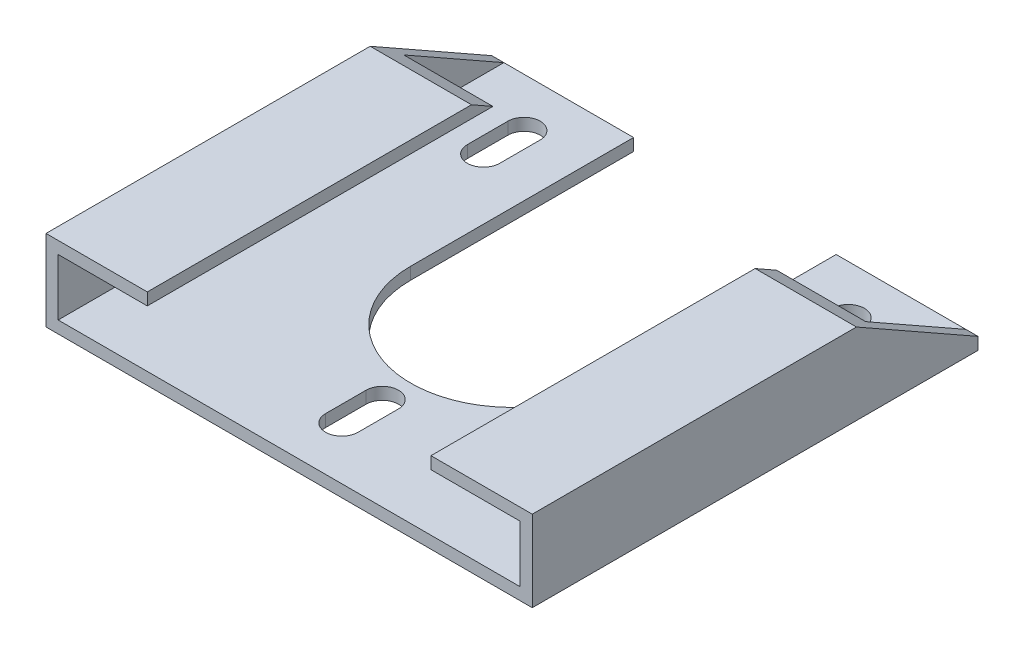
ISO-10303-21;
HEADER;
FILE_DESCRIPTION(('STEP AP214'),'2;1');
FILE_NAME('part.step','',(''),(''),'','','');
FILE_SCHEMA(('AUTOMOTIVE_DESIGN { 1 0 10303 214 1 1 1 1 }'));
ENDSEC;
DATA;
#1=APPLICATION_CONTEXT('core data for automotive mechanical design processes');
#2=APPLICATION_PROTOCOL_DEFINITION('international standard','automotive_design',2000,#1);
#3=PRODUCT_CONTEXT('',#1,'mechanical');
#4=PRODUCT('Part','Part','',(#3));
#5=PRODUCT_RELATED_PRODUCT_CATEGORY('part','',(#4));
#6=PRODUCT_DEFINITION_FORMATION('','',#4);
#7=PRODUCT_DEFINITION_CONTEXT('part definition',#1,'design');
#8=PRODUCT_DEFINITION('design','',#6,#7);
#9=PRODUCT_DEFINITION_SHAPE('','',#8);
#10=(LENGTH_UNIT() NAMED_UNIT(*) SI_UNIT(.MILLI.,.METRE.));
#11=(NAMED_UNIT(*) PLANE_ANGLE_UNIT() SI_UNIT($,.RADIAN.));
#12=(NAMED_UNIT(*) SI_UNIT($,.STERADIAN.) SOLID_ANGLE_UNIT());
#13=UNCERTAINTY_MEASURE_WITH_UNIT(LENGTH_MEASURE(1.E-05),#10,'distance_accuracy_value','');
#14=(GEOMETRIC_REPRESENTATION_CONTEXT(3) GLOBAL_UNCERTAINTY_ASSIGNED_CONTEXT((#13)) GLOBAL_UNIT_ASSIGNED_CONTEXT((#10,
#11,#12)) REPRESENTATION_CONTEXT('',''));
#15=CARTESIAN_POINT('',(0.,0.,0.));
#16=DIRECTION('',(0.,0.,1.));
#17=DIRECTION('',(1.,0.,0.));
#18=AXIS2_PLACEMENT_3D('',#15,#16,#17);
#19=CARTESIAN_POINT('',(0.,3.,0.));
#20=DIRECTION('',(0.,1.,0.));
#21=DIRECTION('',(0.,0.,1.));
#22=AXIS2_PLACEMENT_3D('',#19,#20,#21);
#23=PLANE('',#22);
#24=CARTESIAN_POINT('',(0.,3.,32.));
#25=DIRECTION('',(0.,1.,0.));
#26=DIRECTION('',(0.,0.,1.));
#27=AXIS2_PLACEMENT_3D('',#24,#25,#26);
#28=CIRCLE('',#27,4.);
#29=CARTESIAN_POINT('',(4.,3.,32.));
#30=VERTEX_POINT('',#29);
#31=CARTESIAN_POINT('',(-4.,3.,32.));
#32=VERTEX_POINT('',#31);
#33=EDGE_CURVE('E49',#30,#32,#28,.T.);
#34=ORIENTED_EDGE('',*,*,#33,.F.);
#35=DIRECTION('',(0.,0.,-1.));
#36=VECTOR('',#35,1.);
#37=CARTESIAN_POINT('',(4.,3.,32.));
#38=LINE('',#37,#36);
#39=CARTESIAN_POINT('',(4.,3.,42.));
#40=VERTEX_POINT('',#39);
#41=EDGE_CURVE('E243',#40,#30,#38,.T.);
#42=ORIENTED_EDGE('',*,*,#41,.F.);
#43=CARTESIAN_POINT('',(0.,3.,42.));
#44=DIRECTION('',(0.,1.,0.));
#45=DIRECTION('',(0.,0.,1.));
#46=AXIS2_PLACEMENT_3D('',#43,#44,#45);
#47=CIRCLE('',#46,4.);
#48=CARTESIAN_POINT('',(-4.,3.,42.));
#49=VERTEX_POINT('',#48);
#50=EDGE_CURVE('E228',#49,#40,#47,.T.);
#51=ORIENTED_EDGE('',*,*,#50,.F.);
#52=DIRECTION('',(0.,0.,1.));
#53=VECTOR('',#52,1.);
#54=CARTESIAN_POINT('',(-4.,3.,32.));
#55=LINE('',#54,#53);
#56=EDGE_CURVE('E237',#32,#49,#55,.T.);
#57=ORIENTED_EDGE('',*,*,#56,.F.);
#58=EDGE_LOOP('',(#34,#42,#51,#57));
#59=FACE_BOUND('',#58,.T.);
#60=CARTESIAN_POINT('',(0.,3.,0.));
#61=DIRECTION('',(0.,1.,0.));
#62=DIRECTION('',(0.,0.,1.));
#63=AXIS2_PLACEMENT_3D('',#60,#61,#62);
#64=CIRCLE('',#63,25.);
#65=CARTESIAN_POINT('',(-25.,3.,0.));
#66=VERTEX_POINT('',#65);
#67=CARTESIAN_POINT('',(25.,3.,0.));
#68=VERTEX_POINT('',#67);
#69=EDGE_CURVE('E492',#66,#68,#64,.T.);
#70=ORIENTED_EDGE('',*,*,#69,.F.);
#71=DIRECTION('',(0.,0.,-1.));
#72=VECTOR('',#71,1.);
#73=CARTESIAN_POINT('',(-25.,3.,0.));
#74=LINE('',#73,#72);
#75=CARTESIAN_POINT('',(-25.,3.,-55.));
#76=VERTEX_POINT('',#75);
#77=EDGE_CURVE('E510',#66,#76,#74,.T.);
#78=ORIENTED_EDGE('',*,*,#77,.T.);
#79=DIRECTION('',(1.,0.,0.));
#80=VECTOR('',#79,1.);
#81=CARTESIAN_POINT('',(0.,3.,-55.));
#82=LINE('',#81,#80);
#83=CARTESIAN_POINT('',(-57.,3.00000000000002,-55.));
#84=VERTEX_POINT('',#83);
#85=EDGE_CURVE('E505',#84,#76,#82,.T.);
#86=ORIENTED_EDGE('',*,*,#85,.F.);
#87=DIRECTION('',(0.,0.,1.));
#88=VECTOR('',#87,1.);
#89=CARTESIAN_POINT('',(-57.,3.,0.));
#90=LINE('',#89,#88);
#91=CARTESIAN_POINT('',(-57.,3.,55.));
#92=VERTEX_POINT('',#91);
#93=EDGE_CURVE('E500',#84,#92,#90,.T.);
#94=ORIENTED_EDGE('',*,*,#93,.T.);
#95=DIRECTION('',(1.,0.,0.));
#96=VECTOR('',#95,1.);
#97=CARTESIAN_POINT('',(0.,3.,55.));
#98=LINE('',#97,#96);
#99=CARTESIAN_POINT('',(57.,3.,55.));
#100=VERTEX_POINT('',#99);
#101=EDGE_CURVE('E504',#92,#100,#98,.T.);
#102=ORIENTED_EDGE('',*,*,#101,.T.);
#103=DIRECTION('',(0.,0.,1.));
#104=VECTOR('',#103,1.);
#105=CARTESIAN_POINT('',(57.,3.,0.));
#106=LINE('',#105,#104);
#107=CARTESIAN_POINT('',(57.,3.,-55.));
#108=VERTEX_POINT('',#107);
#109=EDGE_CURVE('E515',#108,#100,#106,.T.);
#110=ORIENTED_EDGE('',*,*,#109,.F.);
#111=DIRECTION('',(1.,0.,0.));
#112=VECTOR('',#111,1.);
#113=CARTESIAN_POINT('',(0.,3.,-55.));
#114=LINE('',#113,#112);
#115=CARTESIAN_POINT('',(25.,3.,-55.));
#116=VERTEX_POINT('',#115);
#117=EDGE_CURVE('E519',#116,#108,#114,.T.);
#118=ORIENTED_EDGE('',*,*,#117,.F.);
#119=DIRECTION('',(0.,0.,-1.));
#120=VECTOR('',#119,1.);
#121=CARTESIAN_POINT('',(25.,3.,0.));
#122=LINE('',#121,#120);
#123=EDGE_CURVE('E496',#68,#116,#122,.T.);
#124=ORIENTED_EDGE('',*,*,#123,.F.);
#125=EDGE_LOOP('',(#70,#78,#86,#94,#102,#110,#118,#124));
#126=FACE_BOUND('',#125,.T.);
#127=CARTESIAN_POINT('',(-40.,3.,-42.9741891997697));
#128=DIRECTION('',(0.,1.,0.));
#129=DIRECTION('',(0.,0.,1.));
#130=AXIS2_PLACEMENT_3D('',#127,#128,#129);
#131=CIRCLE('',#130,4.);
#132=CARTESIAN_POINT('',(-36.,3.,-42.9741891997697));
#133=VERTEX_POINT('',#132);
#134=CARTESIAN_POINT('',(-44.,3.,-42.9741891997697));
#135=VERTEX_POINT('',#134);
#136=EDGE_CURVE('E267',#133,#135,#131,.T.);
#137=ORIENTED_EDGE('',*,*,#136,.F.);
#138=DIRECTION('',(0.,0.,-1.));
#139=VECTOR('',#138,1.);
#140=CARTESIAN_POINT('',(-36.,3.,-42.9741891997697));
#141=LINE('',#140,#139);
#142=CARTESIAN_POINT('',(-36.,3.,-32.9741891997697));
#143=VERTEX_POINT('',#142);
#144=EDGE_CURVE('E281',#143,#133,#141,.T.);
#145=ORIENTED_EDGE('',*,*,#144,.F.);
#146=CARTESIAN_POINT('',(-40.,3.,-32.9741891997697));
#147=DIRECTION('',(0.,1.,0.));
#148=DIRECTION('',(0.,0.,1.));
#149=AXIS2_PLACEMENT_3D('',#146,#147,#148);
#150=CIRCLE('',#149,4.);
#151=CARTESIAN_POINT('',(-44.,3.,-32.9741891997697));
#152=VERTEX_POINT('',#151);
#153=EDGE_CURVE('E278',#152,#143,#150,.T.);
#154=ORIENTED_EDGE('',*,*,#153,.F.);
#155=DIRECTION('',(0.,0.,1.));
#156=VECTOR('',#155,1.);
#157=CARTESIAN_POINT('',(-44.,3.,-42.9741891997697));
#158=LINE('',#157,#156);
#159=EDGE_CURVE('E275',#135,#152,#158,.T.);
#160=ORIENTED_EDGE('',*,*,#159,.F.);
#161=EDGE_LOOP('',(#137,#145,#154,#160));
#162=FACE_BOUND('',#161,.T.);
#163=DIRECTION('',(0.,0.,-1.));
#164=VECTOR('',#163,1.);
#165=CARTESIAN_POINT('',(36.,3.,-42.9741891997697));
#166=LINE('',#165,#164);
#167=CARTESIAN_POINT('',(36.,3.,-32.9741891997697));
#168=VERTEX_POINT('',#167);
#169=CARTESIAN_POINT('',(36.,3.,-42.9741891997697));
#170=VERTEX_POINT('',#169);
#171=EDGE_CURVE('E255',#168,#170,#166,.T.);
#172=ORIENTED_EDGE('',*,*,#171,.T.);
#173=CARTESIAN_POINT('',(40.,3.,-42.9741891997697));
#174=DIRECTION('',(0.,-1.,0.));
#175=DIRECTION('',(0.,0.,1.));
#176=AXIS2_PLACEMENT_3D('',#173,#174,#175);
#177=CIRCLE('',#176,4.);
#178=CARTESIAN_POINT('',(44.,3.,-42.9741891997697));
#179=VERTEX_POINT('',#178);
#180=EDGE_CURVE('E250',#170,#179,#177,.T.);
#181=ORIENTED_EDGE('',*,*,#180,.T.);
#182=DIRECTION('',(0.,0.,1.));
#183=VECTOR('',#182,1.);
#184=CARTESIAN_POINT('',(44.,3.,-42.9741891997697));
#185=LINE('',#184,#183);
#186=CARTESIAN_POINT('',(44.,3.,-32.9741891997697));
#187=VERTEX_POINT('',#186);
#188=EDGE_CURVE('E261',#179,#187,#185,.T.);
#189=ORIENTED_EDGE('',*,*,#188,.T.);
#190=CARTESIAN_POINT('',(40.,3.,-32.9741891997697));
#191=DIRECTION('',(0.,-1.,0.));
#192=DIRECTION('',(0.,0.,1.));
#193=AXIS2_PLACEMENT_3D('',#190,#191,#192);
#194=CIRCLE('',#193,4.);
#195=EDGE_CURVE('E258',#187,#168,#194,.T.);
#196=ORIENTED_EDGE('',*,*,#195,.T.);
#197=EDGE_LOOP('',(#172,#181,#189,#196));
#198=FACE_BOUND('',#197,.T.);
#199=ADVANCED_FACE('F34',(#59,#126,#162,#198),#23,.T.);
#200=CARTESIAN_POINT('',(0.,0.,0.));
#201=DIRECTION('',(0.,1.,0.));
#202=DIRECTION('',(0.,0.,1.));
#203=AXIS2_PLACEMENT_3D('',#200,#201,#202);
#204=PLANE('',#203);
#205=DIRECTION('',(0.,0.,-1.));
#206=VECTOR('',#205,1.);
#207=CARTESIAN_POINT('',(3.99999999999999,0.,0.));
#208=LINE('',#207,#206);
#209=CARTESIAN_POINT('',(4.,0.,42.));
#210=VERTEX_POINT('',#209);
#211=CARTESIAN_POINT('',(4.,0.,32.));
#212=VERTEX_POINT('',#211);
#213=EDGE_CURVE('E42',#210,#212,#208,.T.);
#214=ORIENTED_EDGE('',*,*,#213,.T.);
#215=CARTESIAN_POINT('',(0.,0.,32.));
#216=DIRECTION('',(0.,1.,0.));
#217=DIRECTION('',(0.,0.,1.));
#218=AXIS2_PLACEMENT_3D('',#215,#216,#217);
#219=CIRCLE('',#218,4.);
#220=CARTESIAN_POINT('',(-4.,0.,32.));
#221=VERTEX_POINT('',#220);
#222=EDGE_CURVE('E11',#212,#221,#219,.T.);
#223=ORIENTED_EDGE('',*,*,#222,.T.);
#224=DIRECTION('',(0.,0.,1.));
#225=VECTOR('',#224,1.);
#226=CARTESIAN_POINT('',(-4.,0.,0.));
#227=LINE('',#226,#225);
#228=CARTESIAN_POINT('',(-4.,0.,42.));
#229=VERTEX_POINT('',#228);
#230=EDGE_CURVE('E405',#221,#229,#227,.T.);
#231=ORIENTED_EDGE('',*,*,#230,.T.);
#232=CARTESIAN_POINT('',(0.,0.,42.));
#233=DIRECTION('',(0.,1.,0.));
#234=DIRECTION('',(0.,0.,1.));
#235=AXIS2_PLACEMENT_3D('',#232,#233,#234);
#236=CIRCLE('',#235,4.);
#237=EDGE_CURVE('E231',#229,#210,#236,.T.);
#238=ORIENTED_EDGE('',*,*,#237,.T.);
#239=EDGE_LOOP('',(#214,#223,#231,#238));
#240=FACE_BOUND('',#239,.T.);
#241=CARTESIAN_POINT('',(0.,0.,0.));
#242=DIRECTION('',(0.,1.,0.));
#243=DIRECTION('',(0.,0.,1.));
#244=AXIS2_PLACEMENT_3D('',#241,#242,#243);
#245=CIRCLE('',#244,25.);
#246=CARTESIAN_POINT('',(-25.,0.,0.));
#247=VERTEX_POINT('',#246);
#248=CARTESIAN_POINT('',(25.,0.,0.));
#249=VERTEX_POINT('',#248);
#250=EDGE_CURVE('E474',#247,#249,#245,.T.);
#251=ORIENTED_EDGE('',*,*,#250,.T.);
#252=DIRECTION('',(0.,0.,-1.));
#253=VECTOR('',#252,1.);
#254=CARTESIAN_POINT('',(25.,0.,0.));
#255=LINE('',#254,#253);
#256=CARTESIAN_POINT('',(25.,0.,-55.));
#257=VERTEX_POINT('',#256);
#258=EDGE_CURVE('E489',#249,#257,#255,.T.);
#259=ORIENTED_EDGE('',*,*,#258,.T.);
#260=DIRECTION('',(1.,0.,0.));
#261=VECTOR('',#260,1.);
#262=CARTESIAN_POINT('',(0.,0.,-55.));
#263=LINE('',#262,#261);
#264=CARTESIAN_POINT('',(60.,0.,-55.));
#265=VERTEX_POINT('',#264);
#266=EDGE_CURVE('E483',#257,#265,#263,.T.);
#267=ORIENTED_EDGE('',*,*,#266,.T.);
#268=DIRECTION('',(0.,0.,1.));
#269=VECTOR('',#268,1.);
#270=CARTESIAN_POINT('',(60.,0.,0.));
#271=LINE('',#270,#269);
#272=CARTESIAN_POINT('',(60.,0.,55.));
#273=VERTEX_POINT('',#272);
#274=EDGE_CURVE('E356',#265,#273,#271,.T.);
#275=ORIENTED_EDGE('',*,*,#274,.T.);
#276=DIRECTION('',(1.,0.,0.));
#277=VECTOR('',#276,1.);
#278=CARTESIAN_POINT('',(0.,0.,55.));
#279=LINE('',#278,#277);
#280=CARTESIAN_POINT('',(-60.,0.,55.));
#281=VERTEX_POINT('',#280);
#282=EDGE_CURVE('E481',#281,#273,#279,.T.);
#283=ORIENTED_EDGE('',*,*,#282,.F.);
#284=DIRECTION('',(0.,0.,1.));
#285=VECTOR('',#284,1.);
#286=CARTESIAN_POINT('',(-60.,0.,0.));
#287=LINE('',#286,#285);
#288=CARTESIAN_POINT('',(-60.,0.,-55.));
#289=VERTEX_POINT('',#288);
#290=EDGE_CURVE('E377',#289,#281,#287,.T.);
#291=ORIENTED_EDGE('',*,*,#290,.F.);
#292=DIRECTION('',(1.,0.,0.));
#293=VECTOR('',#292,1.);
#294=CARTESIAN_POINT('',(0.,0.,-55.));
#295=LINE('',#294,#293);
#296=CARTESIAN_POINT('',(-25.,0.,-55.));
#297=VERTEX_POINT('',#296);
#298=EDGE_CURVE('E473',#289,#297,#295,.T.);
#299=ORIENTED_EDGE('',*,*,#298,.T.);
#300=DIRECTION('',(0.,0.,-1.));
#301=VECTOR('',#300,1.);
#302=CARTESIAN_POINT('',(-25.,0.,0.));
#303=LINE('',#302,#301);
#304=EDGE_CURVE('E466',#247,#297,#303,.T.);
#305=ORIENTED_EDGE('',*,*,#304,.F.);
#306=EDGE_LOOP('',(#251,#259,#267,#275,#283,#291,#299,#305));
#307=FACE_BOUND('',#306,.T.);
#308=DIRECTION('',(0.,0.,-1.));
#309=VECTOR('',#308,1.);
#310=CARTESIAN_POINT('',(-36.,0.,0.));
#311=LINE('',#310,#309);
#312=CARTESIAN_POINT('',(-36.,0.,-32.9741891997697));
#313=VERTEX_POINT('',#312);
#314=CARTESIAN_POINT('',(-36.,0.,-42.9741891997697));
#315=VERTEX_POINT('',#314);
#316=EDGE_CURVE('E390',#313,#315,#311,.T.);
#317=ORIENTED_EDGE('',*,*,#316,.T.);
#318=CARTESIAN_POINT('',(-40.,0.,-42.9741891997697));
#319=DIRECTION('',(0.,1.,0.));
#320=DIRECTION('',(0.,0.,1.));
#321=AXIS2_PLACEMENT_3D('',#318,#319,#320);
#322=CIRCLE('',#321,4.);
#323=CARTESIAN_POINT('',(-44.,0.,-42.9741891997697));
#324=VERTEX_POINT('',#323);
#325=EDGE_CURVE('E393',#315,#324,#322,.T.);
#326=ORIENTED_EDGE('',*,*,#325,.T.);
#327=DIRECTION('',(0.,0.,1.));
#328=VECTOR('',#327,1.);
#329=CARTESIAN_POINT('',(-44.,0.,0.));
#330=LINE('',#329,#328);
#331=CARTESIAN_POINT('',(-44.,0.,-32.9741891997697));
#332=VERTEX_POINT('',#331);
#333=EDGE_CURVE('E383',#324,#332,#330,.T.);
#334=ORIENTED_EDGE('',*,*,#333,.T.);
#335=CARTESIAN_POINT('',(-40.,0.,-32.9741891997697));
#336=DIRECTION('',(0.,1.,0.));
#337=DIRECTION('',(0.,0.,1.));
#338=AXIS2_PLACEMENT_3D('',#335,#336,#337);
#339=CIRCLE('',#338,4.);
#340=EDGE_CURVE('E387',#332,#313,#339,.T.);
#341=ORIENTED_EDGE('',*,*,#340,.T.);
#342=EDGE_LOOP('',(#317,#326,#334,#341));
#343=FACE_BOUND('',#342,.T.);
#344=CARTESIAN_POINT('',(40.,0.,-42.9741891997697));
#345=DIRECTION('',(0.,1.,0.));
#346=DIRECTION('',(0.,0.,1.));
#347=AXIS2_PLACEMENT_3D('',#344,#345,#346);
#348=CIRCLE('',#347,4.);
#349=CARTESIAN_POINT('',(36.,0.,-42.9741891997697));
#350=VERTEX_POINT('',#349);
#351=CARTESIAN_POINT('',(44.,0.,-42.9741891997697));
#352=VERTEX_POINT('',#351);
#353=EDGE_CURVE('E403',#350,#352,#348,.F.);
#354=ORIENTED_EDGE('',*,*,#353,.F.);
#355=DIRECTION('',(0.,0.,-1.));
#356=VECTOR('',#355,1.);
#357=CARTESIAN_POINT('',(36.,0.,0.));
#358=LINE('',#357,#356);
#359=CARTESIAN_POINT('',(36.,0.,-32.9741891997697));
#360=VERTEX_POINT('',#359);
#361=EDGE_CURVE('E396',#360,#350,#358,.T.);
#362=ORIENTED_EDGE('',*,*,#361,.F.);
#363=CARTESIAN_POINT('',(40.,0.,-32.9741891997697));
#364=DIRECTION('',(0.,1.,0.));
#365=DIRECTION('',(0.,0.,1.));
#366=AXIS2_PLACEMENT_3D('',#363,#364,#365);
#367=CIRCLE('',#366,4.);
#368=CARTESIAN_POINT('',(44.,0.,-32.9741891997697));
#369=VERTEX_POINT('',#368);
#370=EDGE_CURVE('E398',#369,#360,#367,.F.);
#371=ORIENTED_EDGE('',*,*,#370,.F.);
#372=DIRECTION('',(0.,0.,1.));
#373=VECTOR('',#372,1.);
#374=CARTESIAN_POINT('',(44.,0.,0.));
#375=LINE('',#374,#373);
#376=EDGE_CURVE('E401',#352,#369,#375,.T.);
#377=ORIENTED_EDGE('',*,*,#376,.F.);
#378=EDGE_LOOP('',(#354,#362,#371,#377));
#379=FACE_BOUND('',#378,.T.);
#380=ADVANCED_FACE('F409',(#240,#307,#343,#379),#204,.F.);
#381=CARTESIAN_POINT('',(-57.,20.,0.));
#382=DIRECTION('',(1.,0.,0.));
#383=DIRECTION('',(0.,0.,-1.));
#384=AXIS2_PLACEMENT_3D('',#381,#382,#383);
#385=PLANE('',#384);
#386=ORIENTED_EDGE('',*,*,#93,.F.);
#387=DIRECTION('',(0.,0.49301257198088,0.870022185848612));
#388=VECTOR('',#387,1.);
#389=CARTESIAN_POINT('',(-57.,30.7232968881413,-6.07653490328007));
#390=LINE('',#389,#388);
#391=CARTESIAN_POINT('',(-57.,17.,-30.2941176470589));
#392=VERTEX_POINT('',#391);
#393=EDGE_CURVE('E323',#84,#392,#390,.T.);
#394=ORIENTED_EDGE('',*,*,#393,.T.);
#395=DIRECTION('',(0.,0.,-1.));
#396=VECTOR('',#395,1.);
#397=CARTESIAN_POINT('',(-57.,17.,-55.));
#398=LINE('',#397,#396);
#399=CARTESIAN_POINT('',(-57.,17.,55.));
#400=VERTEX_POINT('',#399);
#401=EDGE_CURVE('E343',#400,#392,#398,.T.);
#402=ORIENTED_EDGE('',*,*,#401,.F.);
#403=DIRECTION('',(0.,-1.,0.));
#404=VECTOR('',#403,1.);
#405=CARTESIAN_POINT('',(-57.,20.,55.));
#406=LINE('',#405,#404);
#407=EDGE_CURVE('E378',#400,#92,#406,.T.);
#408=ORIENTED_EDGE('',*,*,#407,.T.);
#409=EDGE_LOOP('',(#386,#394,#402,#408));
#410=FACE_BOUND('',#409,.T.);
#411=ADVANCED_FACE('F433',(#410),#385,.T.);
#412=CARTESIAN_POINT('',(0.,3.,-55.));
#413=DIRECTION('',(0.,0.,-1.));
#414=DIRECTION('',(-1.,0.,0.));
#415=AXIS2_PLACEMENT_3D('',#412,#413,#414);
#416=PLANE('',#415);
#417=DIRECTION('',(0.,-1.,0.));
#418=VECTOR('',#417,1.);
#419=CARTESIAN_POINT('',(-60.,20.,-55.));
#420=LINE('',#419,#418);
#421=CARTESIAN_POINT('',(-60.,3.00000000000002,-55.));
#422=VERTEX_POINT('',#421);
#423=EDGE_CURVE('E562',#422,#289,#420,.T.);
#424=ORIENTED_EDGE('',*,*,#423,.F.);
#425=DIRECTION('',(1.,0.,0.));
#426=VECTOR('',#425,1.);
#427=CARTESIAN_POINT('',(0.,3.00000000000002,-55.));
#428=LINE('',#427,#426);
#429=EDGE_CURVE('E320',#422,#84,#428,.T.);
#430=ORIENTED_EDGE('',*,*,#429,.T.);
#431=ORIENTED_EDGE('',*,*,#85,.T.);
#432=DIRECTION('',(0.,-1.,0.));
#433=VECTOR('',#432,1.);
#434=CARTESIAN_POINT('',(-25.,3.,-55.));
#435=LINE('',#434,#433);
#436=EDGE_CURVE('E469',#76,#297,#435,.T.);
#437=ORIENTED_EDGE('',*,*,#436,.T.);
#438=ORIENTED_EDGE('',*,*,#298,.F.);
#439=EDGE_LOOP('',(#424,#430,#431,#437,#438));
#440=FACE_BOUND('',#439,.T.);
#441=ADVANCED_FACE('F448',(#440),#416,.T.);
#442=CARTESIAN_POINT('',(0.,3.,-55.));
#443=DIRECTION('',(0.,0.,-1.));
#444=DIRECTION('',(-1.,0.,0.));
#445=AXIS2_PLACEMENT_3D('',#442,#443,#444);
#446=PLANE('',#445);
#447=ORIENTED_EDGE('',*,*,#117,.T.);
#448=DIRECTION('',(1.,0.,0.));
#449=VECTOR('',#448,1.);
#450=CARTESIAN_POINT('',(0.,3.00000000000002,-55.));
#451=LINE('',#450,#449);
#452=CARTESIAN_POINT('',(60.,3.00000000000002,-55.));
#453=VERTEX_POINT('',#452);
#454=EDGE_CURVE('E304',#108,#453,#451,.T.);
#455=ORIENTED_EDGE('',*,*,#454,.T.);
#456=DIRECTION('',(0.,-1.,0.));
#457=VECTOR('',#456,1.);
#458=CARTESIAN_POINT('',(60.,20.,-55.));
#459=LINE('',#458,#457);
#460=EDGE_CURVE('E362',#453,#265,#459,.T.);
#461=ORIENTED_EDGE('',*,*,#460,.T.);
#462=ORIENTED_EDGE('',*,*,#266,.F.);
#463=DIRECTION('',(0.,-1.,0.));
#464=VECTOR('',#463,1.);
#465=CARTESIAN_POINT('',(25.,3.,-55.));
#466=LINE('',#465,#464);
#467=EDGE_CURVE('E495',#116,#257,#466,.T.);
#468=ORIENTED_EDGE('',*,*,#467,.F.);
#469=EDGE_LOOP('',(#447,#455,#461,#462,#468));
#470=FACE_BOUND('',#469,.T.);
#471=ADVANCED_FACE('F445',(#470),#446,.T.);
#472=CARTESIAN_POINT('',(-60.,20.,0.));
#473=DIRECTION('',(1.,0.,0.));
#474=DIRECTION('',(0.,0.,-1.));
#475=AXIS2_PLACEMENT_3D('',#472,#473,#474);
#476=PLANE('',#475);
#477=DIRECTION('',(0.,0.49301257198088,0.870022185848612));
#478=VECTOR('',#477,1.);
#479=CARTESIAN_POINT('',(-60.,30.7232968881413,-6.07653490328007));
#480=LINE('',#479,#478);
#481=CARTESIAN_POINT('',(-60.,20.,-25.));
#482=VERTEX_POINT('',#481);
#483=EDGE_CURVE('E318',#422,#482,#480,.T.);
#484=ORIENTED_EDGE('',*,*,#483,.F.);
#485=ORIENTED_EDGE('',*,*,#423,.T.);
#486=ORIENTED_EDGE('',*,*,#290,.T.);
#487=DIRECTION('',(0.,-1.,0.));
#488=VECTOR('',#487,1.);
#489=CARTESIAN_POINT('',(-60.,20.,55.));
#490=LINE('',#489,#488);
#491=CARTESIAN_POINT('',(-60.,20.,55.));
#492=VERTEX_POINT('',#491);
#493=EDGE_CURVE('E557',#492,#281,#490,.T.);
#494=ORIENTED_EDGE('',*,*,#493,.F.);
#495=DIRECTION('',(0.,0.,1.));
#496=VECTOR('',#495,1.);
#497=CARTESIAN_POINT('',(-60.,20.,0.));
#498=LINE('',#497,#496);
#499=EDGE_CURVE('E372',#482,#492,#498,.T.);
#500=ORIENTED_EDGE('',*,*,#499,.F.);
#501=EDGE_LOOP('',(#484,#485,#486,#494,#500));
#502=FACE_BOUND('',#501,.T.);
#503=ADVANCED_FACE('F436',(#502),#476,.F.);
#504=CARTESIAN_POINT('',(0.,20.,0.));
#505=DIRECTION('',(0.,1.,0.));
#506=DIRECTION('',(0.,0.,1.));
#507=AXIS2_PLACEMENT_3D('',#504,#505,#506);
#508=PLANE('',#507);
#509=DIRECTION('',(0.,0.,1.));
#510=VECTOR('',#509,1.);
#511=CARTESIAN_POINT('',(-35.,20.,55.));
#512=LINE('',#511,#510);
#513=CARTESIAN_POINT('',(-35.,20.,-25.));
#514=VERTEX_POINT('',#513);
#515=CARTESIAN_POINT('',(-35.,20.,55.));
#516=VERTEX_POINT('',#515);
#517=EDGE_CURVE('E344',#514,#516,#512,.T.);
#518=ORIENTED_EDGE('',*,*,#517,.F.);
#519=DIRECTION('',(-1.,0.,0.));
#520=VECTOR('',#519,1.);
#521=CARTESIAN_POINT('',(0.,20.,-25.));
#522=LINE('',#521,#520);
#523=EDGE_CURVE('E315',#514,#482,#522,.T.);
#524=ORIENTED_EDGE('',*,*,#523,.T.);
#525=ORIENTED_EDGE('',*,*,#499,.T.);
#526=DIRECTION('',(1.,0.,0.));
#527=VECTOR('',#526,1.);
#528=CARTESIAN_POINT('',(0.,20.,55.));
#529=LINE('',#528,#527);
#530=EDGE_CURVE('E581',#492,#516,#529,.T.);
#531=ORIENTED_EDGE('',*,*,#530,.T.);
#532=EDGE_LOOP('',(#518,#524,#525,#531));
#533=FACE_BOUND('',#532,.T.);
#534=ADVANCED_FACE('F587',(#533),#508,.T.);
#535=CARTESIAN_POINT('',(57.,20.,0.));
#536=DIRECTION('',(1.,0.,0.));
#537=DIRECTION('',(0.,0.,-1.));
#538=AXIS2_PLACEMENT_3D('',#535,#536,#537);
#539=PLANE('',#538);
#540=DIRECTION('',(0.,0.49301257198088,0.870022185848612));
#541=VECTOR('',#540,1.);
#542=CARTESIAN_POINT('',(57.,30.7232968881413,-6.07653490328007));
#543=LINE('',#542,#541);
#544=CARTESIAN_POINT('',(57.,17.,-30.2941176470589));
#545=VERTEX_POINT('',#544);
#546=EDGE_CURVE('E302',#108,#545,#543,.T.);
#547=ORIENTED_EDGE('',*,*,#546,.F.);
#548=ORIENTED_EDGE('',*,*,#109,.T.);
#549=DIRECTION('',(0.,-1.,0.));
#550=VECTOR('',#549,1.);
#551=CARTESIAN_POINT('',(57.,20.,55.));
#552=LINE('',#551,#550);
#553=CARTESIAN_POINT('',(57.,17.,55.));
#554=VERTEX_POINT('',#553);
#555=EDGE_CURVE('E369',#554,#100,#552,.T.);
#556=ORIENTED_EDGE('',*,*,#555,.F.);
#557=DIRECTION('',(0.,0.,-1.));
#558=VECTOR('',#557,1.);
#559=CARTESIAN_POINT('',(57.,17.,-55.));
#560=LINE('',#559,#558);
#561=EDGE_CURVE('E328',#554,#545,#560,.T.);
#562=ORIENTED_EDGE('',*,*,#561,.T.);
#563=EDGE_LOOP('',(#547,#548,#556,#562));
#564=FACE_BOUND('',#563,.T.);
#565=ADVANCED_FACE('F538',(#564),#539,.F.);
#566=CARTESIAN_POINT('',(60.,20.,0.));
#567=DIRECTION('',(1.,0.,0.));
#568=DIRECTION('',(0.,0.,-1.));
#569=AXIS2_PLACEMENT_3D('',#566,#567,#568);
#570=PLANE('',#569);
#571=ORIENTED_EDGE('',*,*,#460,.F.);
#572=DIRECTION('',(0.,0.49301257198088,0.870022185848612));
#573=VECTOR('',#572,1.);
#574=CARTESIAN_POINT('',(60.,30.7232968881413,-6.07653490328008));
#575=LINE('',#574,#573);
#576=CARTESIAN_POINT('',(60.,20.,-25.));
#577=VERTEX_POINT('',#576);
#578=EDGE_CURVE('E299',#453,#577,#575,.T.);
#579=ORIENTED_EDGE('',*,*,#578,.T.);
#580=DIRECTION('',(0.,0.,1.));
#581=VECTOR('',#580,1.);
#582=CARTESIAN_POINT('',(60.,20.,0.));
#583=LINE('',#582,#581);
#584=CARTESIAN_POINT('',(60.,20.,55.));
#585=VERTEX_POINT('',#584);
#586=EDGE_CURVE('E360',#577,#585,#583,.T.);
#587=ORIENTED_EDGE('',*,*,#586,.T.);
#588=DIRECTION('',(0.,-1.,0.));
#589=VECTOR('',#588,1.);
#590=CARTESIAN_POINT('',(60.,20.,55.));
#591=LINE('',#590,#589);
#592=EDGE_CURVE('E366',#585,#273,#591,.T.);
#593=ORIENTED_EDGE('',*,*,#592,.T.);
#594=ORIENTED_EDGE('',*,*,#274,.F.);
#595=EDGE_LOOP('',(#571,#579,#587,#593,#594));
#596=FACE_BOUND('',#595,.T.);
#597=ADVANCED_FACE('F555',(#596),#570,.T.);
#598=CARTESIAN_POINT('',(0.,20.,0.));
#599=DIRECTION('',(0.,1.,0.));
#600=DIRECTION('',(0.,0.,1.));
#601=AXIS2_PLACEMENT_3D('',#598,#599,#600);
#602=PLANE('',#601);
#603=ORIENTED_EDGE('',*,*,#586,.F.);
#604=DIRECTION('',(-1.,0.,0.));
#605=VECTOR('',#604,1.);
#606=CARTESIAN_POINT('',(0.,20.,-25.));
#607=LINE('',#606,#605);
#608=CARTESIAN_POINT('',(35.,20.,-25.));
#609=VERTEX_POINT('',#608);
#610=EDGE_CURVE('E296',#577,#609,#607,.T.);
#611=ORIENTED_EDGE('',*,*,#610,.T.);
#612=DIRECTION('',(0.,0.,1.));
#613=VECTOR('',#612,1.);
#614=CARTESIAN_POINT('',(35.,20.,55.));
#615=LINE('',#614,#613);
#616=CARTESIAN_POINT('',(35.,20.,55.));
#617=VERTEX_POINT('',#616);
#618=EDGE_CURVE('E331',#609,#617,#615,.T.);
#619=ORIENTED_EDGE('',*,*,#618,.T.);
#620=DIRECTION('',(1.,0.,0.));
#621=VECTOR('',#620,1.);
#622=CARTESIAN_POINT('',(0.,20.,55.));
#623=LINE('',#622,#621);
#624=EDGE_CURVE('E357',#617,#585,#623,.T.);
#625=ORIENTED_EDGE('',*,*,#624,.T.);
#626=EDGE_LOOP('',(#603,#611,#619,#625));
#627=FACE_BOUND('',#626,.T.);
#628=ADVANCED_FACE('F552',(#627),#602,.T.);
#629=CARTESIAN_POINT('',(-35.,17.,-55.));
#630=DIRECTION('',(0.,1.,0.));
#631=DIRECTION('',(0.,0.,1.));
#632=AXIS2_PLACEMENT_3D('',#629,#630,#631);
#633=PLANE('',#632);
#634=DIRECTION('',(-1.,0.,0.));
#635=VECTOR('',#634,1.);
#636=CARTESIAN_POINT('',(-35.,17.,-30.2941176470589));
#637=LINE('',#636,#635);
#638=CARTESIAN_POINT('',(-35.,17.,-30.2941176470589));
#639=VERTEX_POINT('',#638);
#640=EDGE_CURVE('E313',#639,#392,#637,.T.);
#641=ORIENTED_EDGE('',*,*,#640,.F.);
#642=DIRECTION('',(0.,0.,-1.));
#643=VECTOR('',#642,1.);
#644=CARTESIAN_POINT('',(-35.,17.,-55.));
#645=LINE('',#644,#643);
#646=CARTESIAN_POINT('',(-35.,17.,55.));
#647=VERTEX_POINT('',#646);
#648=EDGE_CURVE('E348',#647,#639,#645,.T.);
#649=ORIENTED_EDGE('',*,*,#648,.F.);
#650=DIRECTION('',(-1.,0.,0.));
#651=VECTOR('',#650,1.);
#652=CARTESIAN_POINT('',(-35.,17.,55.));
#653=LINE('',#652,#651);
#654=EDGE_CURVE('E351',#647,#400,#653,.T.);
#655=ORIENTED_EDGE('',*,*,#654,.T.);
#656=ORIENTED_EDGE('',*,*,#401,.T.);
#657=EDGE_LOOP('',(#641,#649,#655,#656));
#658=FACE_BOUND('',#657,.T.);
#659=ADVANCED_FACE('F575',(#658),#633,.F.);
#660=CARTESIAN_POINT('',(-35.,0.,0.));
#661=DIRECTION('',(-1.,0.,0.));
#662=DIRECTION('',(0.,0.,1.));
#663=AXIS2_PLACEMENT_3D('',#660,#661,#662);
#664=PLANE('',#663);
#665=DIRECTION('',(0.,-0.49301257198088,-0.870022185848612));
#666=VECTOR('',#665,1.);
#667=CARTESIAN_POINT('',(-35.,25.8620689655173,-14.6551724137931));
#668=LINE('',#667,#666);
#669=EDGE_CURVE('E309',#514,#639,#668,.T.);
#670=ORIENTED_EDGE('',*,*,#669,.F.);
#671=ORIENTED_EDGE('',*,*,#517,.T.);
#672=DIRECTION('',(0.,-1.,0.));
#673=VECTOR('',#672,1.);
#674=CARTESIAN_POINT('',(-35.,20.,55.));
#675=LINE('',#674,#673);
#676=EDGE_CURVE('E346',#516,#647,#675,.T.);
#677=ORIENTED_EDGE('',*,*,#676,.T.);
#678=ORIENTED_EDGE('',*,*,#648,.T.);
#679=EDGE_LOOP('',(#670,#671,#677,#678));
#680=FACE_BOUND('',#679,.T.);
#681=ADVANCED_FACE('F578',(#680),#664,.F.);
#682=CARTESIAN_POINT('',(35.,17.,-55.));
#683=DIRECTION('',(0.,-1.,0.));
#684=DIRECTION('',(0.,0.,-1.));
#685=AXIS2_PLACEMENT_3D('',#682,#683,#684);
#686=PLANE('',#685);
#687=DIRECTION('',(0.,0.,-1.));
#688=VECTOR('',#687,1.);
#689=CARTESIAN_POINT('',(35.,17.,-55.));
#690=LINE('',#689,#688);
#691=CARTESIAN_POINT('',(35.,17.,55.));
#692=VERTEX_POINT('',#691);
#693=CARTESIAN_POINT('',(35.,17.,-30.2941176470589));
#694=VERTEX_POINT('',#693);
#695=EDGE_CURVE('E333',#692,#694,#690,.T.);
#696=ORIENTED_EDGE('',*,*,#695,.T.);
#697=DIRECTION('',(1.,0.,0.));
#698=VECTOR('',#697,1.);
#699=CARTESIAN_POINT('',(35.,17.,-30.2941176470589));
#700=LINE('',#699,#698);
#701=EDGE_CURVE('E287',#694,#545,#700,.T.);
#702=ORIENTED_EDGE('',*,*,#701,.T.);
#703=ORIENTED_EDGE('',*,*,#561,.F.);
#704=DIRECTION('',(1.,0.,0.));
#705=VECTOR('',#704,1.);
#706=CARTESIAN_POINT('',(35.,17.,55.));
#707=LINE('',#706,#705);
#708=EDGE_CURVE('E339',#692,#554,#707,.T.);
#709=ORIENTED_EDGE('',*,*,#708,.F.);
#710=EDGE_LOOP('',(#696,#702,#703,#709));
#711=FACE_BOUND('',#710,.T.);
#712=ADVANCED_FACE('F543',(#711),#686,.T.);
#713=CARTESIAN_POINT('',(35.,0.,0.));
#714=DIRECTION('',(1.,0.,0.));
#715=DIRECTION('',(0.,0.,1.));
#716=AXIS2_PLACEMENT_3D('',#713,#714,#715);
#717=PLANE('',#716);
#718=DIRECTION('',(0.,0.49301257198088,0.870022185848612));
#719=VECTOR('',#718,1.);
#720=CARTESIAN_POINT('',(35.,25.8620689655173,-14.6551724137931));
#721=LINE('',#720,#719);
#722=EDGE_CURVE('E381',#694,#609,#721,.T.);
#723=ORIENTED_EDGE('',*,*,#722,.F.);
#724=ORIENTED_EDGE('',*,*,#695,.F.);
#725=DIRECTION('',(0.,-1.,0.));
#726=VECTOR('',#725,1.);
#727=CARTESIAN_POINT('',(35.,20.,55.));
#728=LINE('',#727,#726);
#729=EDGE_CURVE('E336',#617,#692,#728,.T.);
#730=ORIENTED_EDGE('',*,*,#729,.F.);
#731=ORIENTED_EDGE('',*,*,#618,.F.);
#732=EDGE_LOOP('',(#723,#724,#730,#731));
#733=FACE_BOUND('',#732,.T.);
#734=ADVANCED_FACE('F461',(#733),#717,.F.);
#735=CARTESIAN_POINT('',(0.,3.,0.));
#736=DIRECTION('',(0.,-1.,0.));
#737=DIRECTION('',(0.,0.,-1.));
#738=AXIS2_PLACEMENT_3D('',#735,#736,#737);
#739=CYLINDRICAL_SURFACE('',#738,25.);
#740=ORIENTED_EDGE('',*,*,#250,.F.);
#741=DIRECTION('',(0.,-1.,0.));
#742=VECTOR('',#741,1.);
#743=CARTESIAN_POINT('',(-25.,3.,0.));
#744=LINE('',#743,#742);
#745=EDGE_CURVE('E384',#66,#247,#744,.T.);
#746=ORIENTED_EDGE('',*,*,#745,.F.);
#747=ORIENTED_EDGE('',*,*,#69,.T.);
#748=DIRECTION('',(0.,-1.,0.));
#749=VECTOR('',#748,1.);
#750=CARTESIAN_POINT('',(25.,3.,0.));
#751=LINE('',#750,#749);
#752=EDGE_CURVE('E493',#68,#249,#751,.T.);
#753=ORIENTED_EDGE('',*,*,#752,.T.);
#754=EDGE_LOOP('',(#740,#746,#747,#753));
#755=FACE_BOUND('',#754,.T.);
#756=ADVANCED_FACE('F36',(#755),#739,.F.);
#757=CARTESIAN_POINT('',(-25.,3.,0.));
#758=DIRECTION('',(-1.,0.,0.));
#759=DIRECTION('',(0.,0.,1.));
#760=AXIS2_PLACEMENT_3D('',#757,#758,#759);
#761=PLANE('',#760);
#762=ORIENTED_EDGE('',*,*,#304,.T.);
#763=ORIENTED_EDGE('',*,*,#436,.F.);
#764=ORIENTED_EDGE('',*,*,#77,.F.);
#765=ORIENTED_EDGE('',*,*,#745,.T.);
#766=EDGE_LOOP('',(#762,#763,#764,#765));
#767=FACE_BOUND('',#766,.T.);
#768=ADVANCED_FACE('F452',(#767),#761,.F.);
#769=CARTESIAN_POINT('',(0.,3.,55.));
#770=DIRECTION('',(0.,0.,-1.));
#771=DIRECTION('',(-1.,0.,0.));
#772=AXIS2_PLACEMENT_3D('',#769,#770,#771);
#773=PLANE('',#772);
#774=ORIENTED_EDGE('',*,*,#282,.T.);
#775=ORIENTED_EDGE('',*,*,#592,.F.);
#776=ORIENTED_EDGE('',*,*,#624,.F.);
#777=ORIENTED_EDGE('',*,*,#729,.T.);
#778=ORIENTED_EDGE('',*,*,#708,.T.);
#779=ORIENTED_EDGE('',*,*,#555,.T.);
#780=ORIENTED_EDGE('',*,*,#101,.F.);
#781=ORIENTED_EDGE('',*,*,#407,.F.);
#782=ORIENTED_EDGE('',*,*,#654,.F.);
#783=ORIENTED_EDGE('',*,*,#676,.F.);
#784=ORIENTED_EDGE('',*,*,#530,.F.);
#785=ORIENTED_EDGE('',*,*,#493,.T.);
#786=EDGE_LOOP('',(#774,#775,#776,#777,#778,#779,#780,#781,#782,#783,#784,#785));
#787=FACE_BOUND('',#786,.T.);
#788=ADVANCED_FACE('F443',(#787),#773,.F.);
#789=CARTESIAN_POINT('',(25.,3.,0.));
#790=DIRECTION('',(-1.,0.,0.));
#791=DIRECTION('',(0.,0.,1.));
#792=AXIS2_PLACEMENT_3D('',#789,#790,#791);
#793=PLANE('',#792);
#794=ORIENTED_EDGE('',*,*,#258,.F.);
#795=ORIENTED_EDGE('',*,*,#752,.F.);
#796=ORIENTED_EDGE('',*,*,#123,.T.);
#797=ORIENTED_EDGE('',*,*,#467,.T.);
#798=EDGE_LOOP('',(#794,#795,#796,#797));
#799=FACE_BOUND('',#798,.T.);
#800=ADVANCED_FACE('F439',(#799),#793,.T.);
#801=CARTESIAN_POINT('',(0.,25.8620689655173,-14.6551724137931));
#802=DIRECTION('',(0.,0.870022185848612,-0.49301257198088));
#803=DIRECTION('',(0.,0.49301257198088,0.870022185848612));
#804=AXIS2_PLACEMENT_3D('',#801,#802,#803);
#805=PLANE('',#804);
#806=ORIENTED_EDGE('',*,*,#546,.T.);
#807=ORIENTED_EDGE('',*,*,#701,.F.);
#808=ORIENTED_EDGE('',*,*,#722,.T.);
#809=ORIENTED_EDGE('',*,*,#610,.F.);
#810=ORIENTED_EDGE('',*,*,#578,.F.);
#811=ORIENTED_EDGE('',*,*,#454,.F.);
#812=EDGE_LOOP('',(#806,#807,#808,#809,#810,#811));
#813=FACE_BOUND('',#812,.T.);
#814=ADVANCED_FACE('F442',(#813),#805,.T.);
#815=ORIENTED_EDGE('',*,*,#429,.F.);
#816=ORIENTED_EDGE('',*,*,#483,.T.);
#817=ORIENTED_EDGE('',*,*,#523,.F.);
#818=ORIENTED_EDGE('',*,*,#669,.T.);
#819=ORIENTED_EDGE('',*,*,#640,.T.);
#820=ORIENTED_EDGE('',*,*,#393,.F.);
#821=EDGE_LOOP('',(#815,#816,#817,#818,#819,#820));
#822=FACE_BOUND('',#821,.T.);
#823=ADVANCED_FACE('F589',(#822),#805,.T.);
#824=CARTESIAN_POINT('',(-40.,-19.,-42.9741891997697));
#825=DIRECTION('',(0.,1.,0.));
#826=DIRECTION('',(0.,0.,1.));
#827=AXIS2_PLACEMENT_3D('',#824,#825,#826);
#828=CYLINDRICAL_SURFACE('',#827,4.);
#829=DIRECTION('',(0.,1.,0.));
#830=VECTOR('',#829,1.);
#831=CARTESIAN_POINT('',(-36.,-19.,-42.9741891997697));
#832=LINE('',#831,#830);
#833=EDGE_CURVE('E285',#315,#133,#832,.T.);
#834=ORIENTED_EDGE('',*,*,#833,.T.);
#835=ORIENTED_EDGE('',*,*,#136,.T.);
#836=DIRECTION('',(0.,1.,0.));
#837=VECTOR('',#836,1.);
#838=CARTESIAN_POINT('',(-44.,-19.,-42.9741891997697));
#839=LINE('',#838,#837);
#840=EDGE_CURVE('E284',#324,#135,#839,.T.);
#841=ORIENTED_EDGE('',*,*,#840,.F.);
#842=ORIENTED_EDGE('',*,*,#325,.F.);
#843=EDGE_LOOP('',(#834,#835,#841,#842));
#844=FACE_BOUND('',#843,.T.);
#845=ADVANCED_FACE('F612',(#844),#828,.F.);
#846=CARTESIAN_POINT('',(-36.,-19.,-42.9741891997697));
#847=DIRECTION('',(1.,0.,0.));
#848=DIRECTION('',(0.,0.,-1.));
#849=AXIS2_PLACEMENT_3D('',#846,#847,#848);
#850=PLANE('',#849);
#851=DIRECTION('',(0.,1.,0.));
#852=VECTOR('',#851,1.);
#853=CARTESIAN_POINT('',(-36.,-19.,-32.9741891997697));
#854=LINE('',#853,#852);
#855=EDGE_CURVE('E288',#313,#143,#854,.T.);
#856=ORIENTED_EDGE('',*,*,#855,.T.);
#857=ORIENTED_EDGE('',*,*,#144,.T.);
#858=ORIENTED_EDGE('',*,*,#833,.F.);
#859=ORIENTED_EDGE('',*,*,#316,.F.);
#860=EDGE_LOOP('',(#856,#857,#858,#859));
#861=FACE_BOUND('',#860,.T.);
#862=ADVANCED_FACE('F615',(#861),#850,.F.);
#863=CARTESIAN_POINT('',(-40.,-19.,-32.9741891997697));
#864=DIRECTION('',(0.,1.,0.));
#865=DIRECTION('',(0.,0.,1.));
#866=AXIS2_PLACEMENT_3D('',#863,#864,#865);
#867=CYLINDRICAL_SURFACE('',#866,4.);
#868=DIRECTION('',(0.,1.,0.));
#869=VECTOR('',#868,1.);
#870=CARTESIAN_POINT('',(-44.,-19.,-32.9741891997697));
#871=LINE('',#870,#869);
#872=EDGE_CURVE('E290',#332,#152,#871,.T.);
#873=ORIENTED_EDGE('',*,*,#872,.T.);
#874=ORIENTED_EDGE('',*,*,#153,.T.);
#875=ORIENTED_EDGE('',*,*,#855,.F.);
#876=ORIENTED_EDGE('',*,*,#340,.F.);
#877=EDGE_LOOP('',(#873,#874,#875,#876));
#878=FACE_BOUND('',#877,.T.);
#879=ADVANCED_FACE('F621',(#878),#867,.F.);
#880=CARTESIAN_POINT('',(-44.,-19.,-42.9741891997697));
#881=DIRECTION('',(-1.,0.,0.));
#882=DIRECTION('',(0.,0.,1.));
#883=AXIS2_PLACEMENT_3D('',#880,#881,#882);
#884=PLANE('',#883);
#885=ORIENTED_EDGE('',*,*,#840,.T.);
#886=ORIENTED_EDGE('',*,*,#159,.T.);
#887=ORIENTED_EDGE('',*,*,#872,.F.);
#888=ORIENTED_EDGE('',*,*,#333,.F.);
#889=EDGE_LOOP('',(#885,#886,#887,#888));
#890=FACE_BOUND('',#889,.T.);
#891=ADVANCED_FACE('F617',(#890),#884,.F.);
#892=CARTESIAN_POINT('',(40.,-19.,-42.9741891997697));
#893=DIRECTION('',(0.,1.,0.));
#894=DIRECTION('',(0.,0.,1.));
#895=AXIS2_PLACEMENT_3D('',#892,#893,#894);
#896=CYLINDRICAL_SURFACE('',#895,4.);
#897=ORIENTED_EDGE('',*,*,#353,.T.);
#898=DIRECTION('',(0.,1.,0.));
#899=VECTOR('',#898,1.);
#900=CARTESIAN_POINT('',(44.,-19.,-42.9741891997697));
#901=LINE('',#900,#899);
#902=EDGE_CURVE('E265',#352,#179,#901,.T.);
#903=ORIENTED_EDGE('',*,*,#902,.T.);
#904=ORIENTED_EDGE('',*,*,#180,.F.);
#905=DIRECTION('',(0.,1.,0.));
#906=VECTOR('',#905,1.);
#907=CARTESIAN_POINT('',(36.,-19.,-42.9741891997697));
#908=LINE('',#907,#906);
#909=EDGE_CURVE('E264',#350,#170,#908,.T.);
#910=ORIENTED_EDGE('',*,*,#909,.F.);
#911=EDGE_LOOP('',(#897,#903,#904,#910));
#912=FACE_BOUND('',#911,.T.);
#913=ADVANCED_FACE('F620',(#912),#896,.F.);
#914=CARTESIAN_POINT('',(44.,-19.,-42.9741891997697));
#915=DIRECTION('',(-1.,0.,0.));
#916=DIRECTION('',(0.,0.,1.));
#917=AXIS2_PLACEMENT_3D('',#914,#915,#916);
#918=PLANE('',#917);
#919=ORIENTED_EDGE('',*,*,#376,.T.);
#920=DIRECTION('',(0.,1.,0.));
#921=VECTOR('',#920,1.);
#922=CARTESIAN_POINT('',(44.,-19.,-32.9741891997697));
#923=LINE('',#922,#921);
#924=EDGE_CURVE('E268',#369,#187,#923,.T.);
#925=ORIENTED_EDGE('',*,*,#924,.T.);
#926=ORIENTED_EDGE('',*,*,#188,.F.);
#927=ORIENTED_EDGE('',*,*,#902,.F.);
#928=EDGE_LOOP('',(#919,#925,#926,#927));
#929=FACE_BOUND('',#928,.T.);
#930=ADVANCED_FACE('F630',(#929),#918,.T.);
#931=CARTESIAN_POINT('',(40.,-19.,-32.9741891997697));
#932=DIRECTION('',(0.,1.,0.));
#933=DIRECTION('',(0.,0.,1.));
#934=AXIS2_PLACEMENT_3D('',#931,#932,#933);
#935=CYLINDRICAL_SURFACE('',#934,4.);
#936=ORIENTED_EDGE('',*,*,#370,.T.);
#937=DIRECTION('',(0.,1.,0.));
#938=VECTOR('',#937,1.);
#939=CARTESIAN_POINT('',(36.,-19.,-32.9741891997697));
#940=LINE('',#939,#938);
#941=EDGE_CURVE('E270',#360,#168,#940,.T.);
#942=ORIENTED_EDGE('',*,*,#941,.T.);
#943=ORIENTED_EDGE('',*,*,#195,.F.);
#944=ORIENTED_EDGE('',*,*,#924,.F.);
#945=EDGE_LOOP('',(#936,#942,#943,#944));
#946=FACE_BOUND('',#945,.T.);
#947=ADVANCED_FACE('F423',(#946),#935,.F.);
#948=CARTESIAN_POINT('',(36.,-19.,-42.9741891997697));
#949=DIRECTION('',(1.,0.,0.));
#950=DIRECTION('',(0.,0.,-1.));
#951=AXIS2_PLACEMENT_3D('',#948,#949,#950);
#952=PLANE('',#951);
#953=ORIENTED_EDGE('',*,*,#361,.T.);
#954=ORIENTED_EDGE('',*,*,#909,.T.);
#955=ORIENTED_EDGE('',*,*,#171,.F.);
#956=ORIENTED_EDGE('',*,*,#941,.F.);
#957=EDGE_LOOP('',(#953,#954,#955,#956));
#958=FACE_BOUND('',#957,.T.);
#959=ADVANCED_FACE('F416',(#958),#952,.T.);
#960=CARTESIAN_POINT('',(0.,-19.,32.));
#961=DIRECTION('',(0.,1.,0.));
#962=DIRECTION('',(0.,0.,1.));
#963=AXIS2_PLACEMENT_3D('',#960,#961,#962);
#964=CYLINDRICAL_SURFACE('',#963,4.);
#965=DIRECTION('',(0.,1.,0.));
#966=VECTOR('',#965,1.);
#967=CARTESIAN_POINT('',(4.,-19.,32.));
#968=LINE('',#967,#966);
#969=EDGE_CURVE('E248',#212,#30,#968,.T.);
#970=ORIENTED_EDGE('',*,*,#969,.T.);
#971=ORIENTED_EDGE('',*,*,#33,.T.);
#972=DIRECTION('',(0.,1.,0.));
#973=VECTOR('',#972,1.);
#974=CARTESIAN_POINT('',(-4.,-19.,32.));
#975=LINE('',#974,#973);
#976=EDGE_CURVE('E234',#221,#32,#975,.T.);
#977=ORIENTED_EDGE('',*,*,#976,.F.);
#978=ORIENTED_EDGE('',*,*,#222,.F.);
#979=EDGE_LOOP('',(#970,#971,#977,#978));
#980=FACE_BOUND('',#979,.T.);
#981=ADVANCED_FACE('F414',(#980),#964,.F.);
#982=CARTESIAN_POINT('',(4.,-19.,32.));
#983=DIRECTION('',(1.,0.,0.));
#984=DIRECTION('',(0.,0.,-1.));
#985=AXIS2_PLACEMENT_3D('',#982,#983,#984);
#986=PLANE('',#985);
#987=DIRECTION('',(0.,1.,0.));
#988=VECTOR('',#987,1.);
#989=CARTESIAN_POINT('',(4.,-19.,42.));
#990=LINE('',#989,#988);
#991=EDGE_CURVE('E233',#210,#40,#990,.T.);
#992=ORIENTED_EDGE('',*,*,#991,.T.);
#993=ORIENTED_EDGE('',*,*,#41,.T.);
#994=ORIENTED_EDGE('',*,*,#969,.F.);
#995=ORIENTED_EDGE('',*,*,#213,.F.);
#996=EDGE_LOOP('',(#992,#993,#994,#995));
#997=FACE_BOUND('',#996,.T.);
#998=ADVANCED_FACE('F413',(#997),#986,.F.);
#999=CARTESIAN_POINT('',(0.,-19.,42.));
#1000=DIRECTION('',(0.,1.,0.));
#1001=DIRECTION('',(0.,0.,1.));
#1002=AXIS2_PLACEMENT_3D('',#999,#1000,#1001);
#1003=CYLINDRICAL_SURFACE('',#1002,4.);
#1004=DIRECTION('',(0.,1.,0.));
#1005=VECTOR('',#1004,1.);
#1006=CARTESIAN_POINT('',(-4.,-19.,42.));
#1007=LINE('',#1006,#1005);
#1008=EDGE_CURVE('E57',#229,#49,#1007,.T.);
#1009=ORIENTED_EDGE('',*,*,#1008,.T.);
#1010=ORIENTED_EDGE('',*,*,#50,.T.);
#1011=ORIENTED_EDGE('',*,*,#991,.F.);
#1012=ORIENTED_EDGE('',*,*,#237,.F.);
#1013=EDGE_LOOP('',(#1009,#1010,#1011,#1012));
#1014=FACE_BOUND('',#1013,.T.);
#1015=ADVANCED_FACE('F225',(#1014),#1003,.F.);
#1016=CARTESIAN_POINT('',(-4.,-19.,32.));
#1017=DIRECTION('',(-1.,0.,0.));
#1018=DIRECTION('',(0.,0.,1.));
#1019=AXIS2_PLACEMENT_3D('',#1016,#1017,#1018);
#1020=PLANE('',#1019);
#1021=ORIENTED_EDGE('',*,*,#976,.T.);
#1022=ORIENTED_EDGE('',*,*,#56,.T.);
#1023=ORIENTED_EDGE('',*,*,#1008,.F.);
#1024=ORIENTED_EDGE('',*,*,#230,.F.);
#1025=EDGE_LOOP('',(#1021,#1022,#1023,#1024));
#1026=FACE_BOUND('',#1025,.T.);
#1027=ADVANCED_FACE('F238',(#1026),#1020,.F.);
#1028=CLOSED_SHELL('',(#199,#380,#411,#441,#471,#503,#534,#565,#597,#628,#659,#681,#712,#734,
#756,#768,#788,#800,#814,#823,#845,#862,#879,#891,#913,#930,#947,#959,#981,#998,#1015,#1027));
#1029=MANIFOLD_SOLID_BREP('B2',#1028);
#1030=ADVANCED_BREP_SHAPE_REPRESENTATION('',(#18,#1029),#14);
#1031=SHAPE_DEFINITION_REPRESENTATION(#9,#1030);
ENDSEC;
END-ISO-10303-21;
